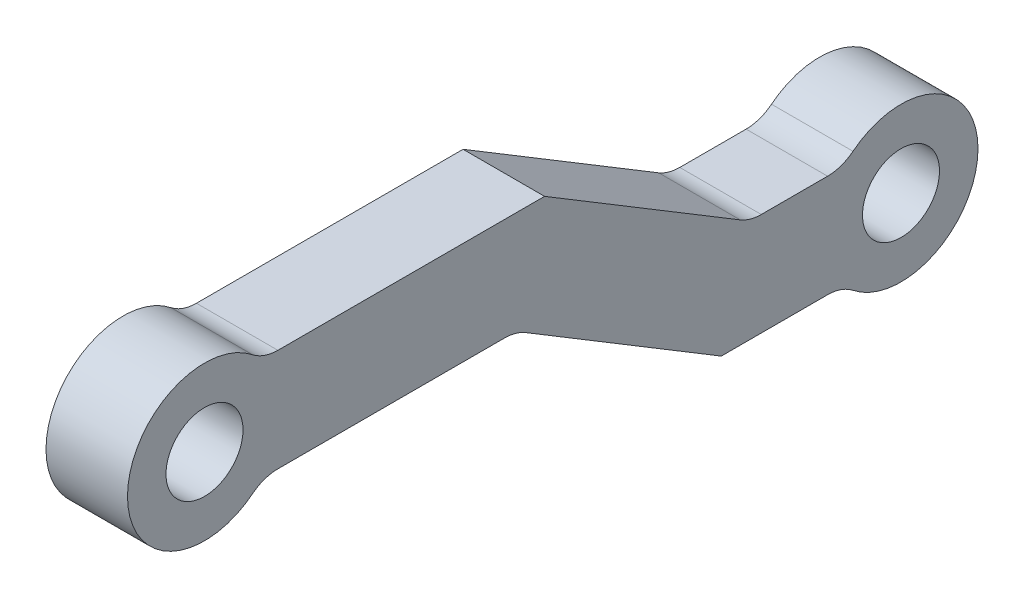
ISO-10303-21;
HEADER;
FILE_DESCRIPTION(('STEP AP214'),'2;1');
FILE_NAME('part.step','',(''),(''),'','','');
FILE_SCHEMA(('AUTOMOTIVE_DESIGN { 1 0 10303 214 1 1 1 1 }'));
ENDSEC;
DATA;
#1=APPLICATION_CONTEXT('core data for automotive mechanical design processes');
#2=APPLICATION_PROTOCOL_DEFINITION('international standard','automotive_design',2000,#1);
#3=PRODUCT_CONTEXT('',#1,'mechanical');
#4=PRODUCT('Part','Part','',(#3));
#5=PRODUCT_RELATED_PRODUCT_CATEGORY('part','',(#4));
#6=PRODUCT_DEFINITION_FORMATION('','',#4);
#7=PRODUCT_DEFINITION_CONTEXT('part definition',#1,'design');
#8=PRODUCT_DEFINITION('design','',#6,#7);
#9=PRODUCT_DEFINITION_SHAPE('','',#8);
#10=(LENGTH_UNIT() NAMED_UNIT(*) SI_UNIT(.MILLI.,.METRE.));
#11=(NAMED_UNIT(*) PLANE_ANGLE_UNIT() SI_UNIT($,.RADIAN.));
#12=(NAMED_UNIT(*) SI_UNIT($,.STERADIAN.) SOLID_ANGLE_UNIT());
#13=UNCERTAINTY_MEASURE_WITH_UNIT(LENGTH_MEASURE(1.E-05),#10,'distance_accuracy_value','');
#14=(GEOMETRIC_REPRESENTATION_CONTEXT(3) GLOBAL_UNCERTAINTY_ASSIGNED_CONTEXT((#13)) GLOBAL_UNIT_ASSIGNED_CONTEXT((#10,
#11,#12)) REPRESENTATION_CONTEXT('',''));
#15=CARTESIAN_POINT('',(0.,0.,0.));
#16=DIRECTION('',(0.,0.,1.));
#17=DIRECTION('',(1.,0.,0.));
#18=AXIS2_PLACEMENT_3D('',#15,#16,#17);
#19=CARTESIAN_POINT('',(3.175,-2.83310697109517,0.));
#20=DIRECTION('',(0.,1.,0.));
#21=DIRECTION('',(0.,0.,1.));
#22=AXIS2_PLACEMENT_3D('',#19,#20,#21);
#23=PLANE('',#22);
#24=DIRECTION('',(0.,0.,-1.));
#25=VECTOR('',#24,1.);
#26=CARTESIAN_POINT('',(0.,-2.83310697109517,0.));
#27=LINE('',#26,#25);
#28=CARTESIAN_POINT('',(0.,-2.83310697109517,-21.689696054792));
#29=VERTEX_POINT('',#28);
#30=CARTESIAN_POINT('',(0.,-2.83310697109517,-24.2737119489963));
#31=VERTEX_POINT('',#30);
#32=EDGE_CURVE('E257',#29,#31,#27,.T.);
#33=ORIENTED_EDGE('',*,*,#32,.F.);
#34=DIRECTION('',(-1.,0.,0.));
#35=VECTOR('',#34,1.);
#36=CARTESIAN_POINT('',(3.175,-2.83310697109517,-21.689696054792));
#37=LINE('',#36,#35);
#38=CARTESIAN_POINT('',(3.175,-2.83310697109517,-21.689696054792));
#39=VERTEX_POINT('',#38);
#40=EDGE_CURVE('E327',#29,#39,#37,.F.);
#41=ORIENTED_EDGE('',*,*,#40,.T.);
#42=DIRECTION('',(0.,0.,-1.));
#43=VECTOR('',#42,1.);
#44=CARTESIAN_POINT('',(3.175,-2.83310697109517,0.));
#45=LINE('',#44,#43);
#46=CARTESIAN_POINT('',(3.175,-2.83310697109517,-24.2737119489963));
#47=VERTEX_POINT('',#46);
#48=EDGE_CURVE('E241',#39,#47,#45,.T.);
#49=ORIENTED_EDGE('',*,*,#48,.T.);
#50=DIRECTION('',(-1.,0.,0.));
#51=VECTOR('',#50,1.);
#52=CARTESIAN_POINT('',(3.175,-2.83310697109517,-24.2737119489963));
#53=LINE('',#52,#51);
#54=EDGE_CURVE('E323',#47,#31,#53,.T.);
#55=ORIENTED_EDGE('',*,*,#54,.T.);
#56=EDGE_LOOP('',(#33,#41,#49,#55));
#57=FACE_BOUND('',#56,.T.);
#58=ADVANCED_FACE('F113',(#57),#23,.T.);
#59=CARTESIAN_POINT('',(3.175,7.32848216707025,-4.42741728115174));
#60=DIRECTION('',(0.,0.855926261123693,-0.517097897422544));
#61=DIRECTION('',(0.,0.517097897422544,0.855926261123693));
#62=AXIS2_PLACEMENT_3D('',#59,#60,#61);
#63=PLANE('',#62);
#64=DIRECTION('',(0.,-0.517097897422544,-0.855926261123693));
#65=VECTOR('',#64,1.);
#66=CARTESIAN_POINT('',(3.175,7.32848216707025,-4.42741728115174));
#67=LINE('',#66,#65);
#68=CARTESIAN_POINT('',(3.175,2.,-13.2473870421154));
#69=VERTEX_POINT('',#68);
#70=CARTESIAN_POINT('',(3.175,-2.60438991062904,-20.8688031426337));
#71=VERTEX_POINT('',#70);
#72=EDGE_CURVE('E221',#69,#71,#67,.T.);
#73=ORIENTED_EDGE('',*,*,#72,.T.);
#74=DIRECTION('',(-1.,0.,0.));
#75=VECTOR('',#74,1.);
#76=CARTESIAN_POINT('',(0.,-2.60438991062904,-20.8688031426337));
#77=LINE('',#76,#75);
#78=CARTESIAN_POINT('',(0.,-2.60438991062904,-20.8688031426337));
#79=VERTEX_POINT('',#78);
#80=EDGE_CURVE('E320',#71,#79,#77,.T.);
#81=ORIENTED_EDGE('',*,*,#80,.T.);
#82=DIRECTION('',(0.,-0.517097897422544,-0.855926261123693));
#83=VECTOR('',#82,1.);
#84=CARTESIAN_POINT('',(0.,7.32848216707025,-4.42741728115174));
#85=LINE('',#84,#83);
#86=CARTESIAN_POINT('',(0.,2.,-13.2473870421154));
#87=VERTEX_POINT('',#86);
#88=EDGE_CURVE('E229',#87,#79,#85,.T.);
#89=ORIENTED_EDGE('',*,*,#88,.F.);
#90=DIRECTION('',(-1.,0.,0.));
#91=VECTOR('',#90,1.);
#92=CARTESIAN_POINT('',(3.175,2.,-13.2473870421154));
#93=LINE('',#92,#91);
#94=EDGE_CURVE('E214',#69,#87,#93,.T.);
#95=ORIENTED_EDGE('',*,*,#94,.F.);
#96=EDGE_LOOP('',(#73,#81,#89,#95));
#97=FACE_BOUND('',#96,.T.);
#98=ADVANCED_FACE('F225',(#97),#63,.T.);
#99=CARTESIAN_POINT('',(3.175,2.,0.));
#100=DIRECTION('',(0.,1.,0.));
#101=DIRECTION('',(0.,0.,1.));
#102=AXIS2_PLACEMENT_3D('',#99,#100,#101);
#103=PLANE('',#102);
#104=DIRECTION('',(0.,0.,-1.));
#105=VECTOR('',#104,1.);
#106=CARTESIAN_POINT('',(0.,2.,0.));
#107=LINE('',#106,#105);
#108=CARTESIAN_POINT('',(0.,2.,-2.85919569109916));
#109=VERTEX_POINT('',#108);
#110=EDGE_CURVE('E264',#109,#87,#107,.T.);
#111=ORIENTED_EDGE('',*,*,#110,.F.);
#112=DIRECTION('',(-1.,0.,0.));
#113=VECTOR('',#112,1.);
#114=CARTESIAN_POINT('',(3.175,2.,-2.85919569109916));
#115=LINE('',#114,#113);
#116=CARTESIAN_POINT('',(3.175,2.,-2.85919569109916));
#117=VERTEX_POINT('',#116);
#118=EDGE_CURVE('E129',#109,#117,#115,.F.);
#119=ORIENTED_EDGE('',*,*,#118,.T.);
#120=DIRECTION('',(0.,0.,-1.));
#121=VECTOR('',#120,1.);
#122=CARTESIAN_POINT('',(3.175,2.,0.));
#123=LINE('',#122,#121);
#124=EDGE_CURVE('E211',#117,#69,#123,.T.);
#125=ORIENTED_EDGE('',*,*,#124,.T.);
#126=ORIENTED_EDGE('',*,*,#94,.T.);
#127=EDGE_LOOP('',(#111,#119,#125,#126));
#128=FACE_BOUND('',#127,.T.);
#129=ADVANCED_FACE('F213',(#128),#103,.T.);
#130=CARTESIAN_POINT('',(3.175,-2.,0.));
#131=DIRECTION('',(0.,1.,0.));
#132=DIRECTION('',(0.,0.,1.));
#133=AXIS2_PLACEMENT_3D('',#130,#131,#132);
#134=PLANE('',#133);
#135=DIRECTION('',(0.,0.,-1.));
#136=VECTOR('',#135,1.);
#137=CARTESIAN_POINT('',(0.,-2.,0.));
#138=LINE('',#137,#136);
#139=CARTESIAN_POINT('',(0.,-2.,-2.85919569109916));
#140=VERTEX_POINT('',#139);
#141=CARTESIAN_POINT('',(0.,-2.,-11.6905986274188));
#142=VERTEX_POINT('',#141);
#143=EDGE_CURVE('E267',#140,#142,#138,.T.);
#144=ORIENTED_EDGE('',*,*,#143,.T.);
#145=DIRECTION('',(-1.,0.,0.));
#146=VECTOR('',#145,1.);
#147=CARTESIAN_POINT('',(3.175,-2.,-11.6905986274188));
#148=LINE('',#147,#146);
#149=CARTESIAN_POINT('',(3.175,-2.,-11.6905986274188));
#150=VERTEX_POINT('',#149);
#151=EDGE_CURVE('E338',#142,#150,#148,.F.);
#152=ORIENTED_EDGE('',*,*,#151,.T.);
#153=DIRECTION('',(0.,0.,-1.));
#154=VECTOR('',#153,1.);
#155=CARTESIAN_POINT('',(3.175,-2.,0.));
#156=LINE('',#155,#154);
#157=CARTESIAN_POINT('',(3.175,-2.,-2.85919569109916));
#158=VERTEX_POINT('',#157);
#159=EDGE_CURVE('E220',#158,#150,#156,.T.);
#160=ORIENTED_EDGE('',*,*,#159,.F.);
#161=DIRECTION('',(1.,0.,0.));
#162=VECTOR('',#161,1.);
#163=CARTESIAN_POINT('',(0.,-2.,-2.85919569109916));
#164=LINE('',#163,#162);
#165=EDGE_CURVE('E334',#158,#140,#164,.F.);
#166=ORIENTED_EDGE('',*,*,#165,.T.);
#167=EDGE_LOOP('',(#144,#152,#160,#166));
#168=FACE_BOUND('',#167,.T.);
#169=ADVANCED_FACE('F412',(#168),#134,.F.);
#170=CARTESIAN_POINT('',(3.175,3.90477712257548,-2.35902569146156));
#171=DIRECTION('',(0.,0.855926261123693,-0.517097897422544));
#172=DIRECTION('',(0.,0.517097897422544,0.855926261123693));
#173=AXIS2_PLACEMENT_3D('',#170,#171,#172);
#174=PLANE('',#173);
#175=DIRECTION('',(0.,-0.517097897422544,-0.855926261123693));
#176=VECTOR('',#175,1.);
#177=CARTESIAN_POINT('',(3.175,3.90477712257548,-2.35902569146156));
#178=LINE('',#177,#176);
#179=CARTESIAN_POINT('',(3.175,-2.22871706046614,-12.5114915395771));
#180=VERTEX_POINT('',#179);
#181=CARTESIAN_POINT('',(3.175,-6.83310697109518,-20.1329076400955));
#182=VERTEX_POINT('',#181);
#183=EDGE_CURVE('E251',#180,#182,#178,.T.);
#184=ORIENTED_EDGE('',*,*,#183,.F.);
#185=DIRECTION('',(-1.,0.,0.));
#186=VECTOR('',#185,1.);
#187=CARTESIAN_POINT('',(0.,-2.22871706046614,-12.5114915395771));
#188=LINE('',#187,#186);
#189=CARTESIAN_POINT('',(0.,-2.22871706046614,-12.5114915395771));
#190=VERTEX_POINT('',#189);
#191=EDGE_CURVE('E330',#180,#190,#188,.T.);
#192=ORIENTED_EDGE('',*,*,#191,.T.);
#193=DIRECTION('',(0.,-0.517097897422544,-0.855926261123693));
#194=VECTOR('',#193,1.);
#195=CARTESIAN_POINT('',(0.,3.90477712257548,-2.35902569146156));
#196=LINE('',#195,#194);
#197=CARTESIAN_POINT('',(0.,-6.83310697109518,-20.1329076400955));
#198=VERTEX_POINT('',#197);
#199=EDGE_CURVE('E271',#190,#198,#196,.T.);
#200=ORIENTED_EDGE('',*,*,#199,.T.);
#201=DIRECTION('',(-1.,0.,0.));
#202=VECTOR('',#201,1.);
#203=CARTESIAN_POINT('',(3.175,-6.83310697109518,-20.1329076400955));
#204=LINE('',#203,#202);
#205=EDGE_CURVE('E232',#182,#198,#204,.T.);
#206=ORIENTED_EDGE('',*,*,#205,.F.);
#207=EDGE_LOOP('',(#184,#192,#200,#206));
#208=FACE_BOUND('',#207,.T.);
#209=ADVANCED_FACE('F406',(#208),#174,.F.);
#210=CARTESIAN_POINT('',(3.175,-6.83310697109517,0.));
#211=DIRECTION('',(0.,1.,0.));
#212=DIRECTION('',(0.,0.,1.));
#213=AXIS2_PLACEMENT_3D('',#210,#211,#212);
#214=PLANE('',#213);
#215=DIRECTION('',(0.,0.,-1.));
#216=VECTOR('',#215,1.);
#217=CARTESIAN_POINT('',(0.,-6.83310697109517,0.));
#218=LINE('',#217,#216);
#219=CARTESIAN_POINT('',(0.,-6.83310697109517,-24.2737119489963));
#220=VERTEX_POINT('',#219);
#221=EDGE_CURVE('E245',#198,#220,#218,.T.);
#222=ORIENTED_EDGE('',*,*,#221,.T.);
#223=DIRECTION('',(1.,0.,0.));
#224=VECTOR('',#223,1.);
#225=CARTESIAN_POINT('',(3.175,-6.83310697109517,-24.2737119489963));
#226=LINE('',#225,#224);
#227=CARTESIAN_POINT('',(3.175,-6.83310697109517,-24.2737119489963));
#228=VERTEX_POINT('',#227);
#229=EDGE_CURVE('E317',#220,#228,#226,.T.);
#230=ORIENTED_EDGE('',*,*,#229,.T.);
#231=DIRECTION('',(0.,0.,-1.));
#232=VECTOR('',#231,1.);
#233=CARTESIAN_POINT('',(3.175,-6.83310697109517,0.));
#234=LINE('',#233,#232);
#235=EDGE_CURVE('E254',#182,#228,#234,.T.);
#236=ORIENTED_EDGE('',*,*,#235,.F.);
#237=ORIENTED_EDGE('',*,*,#205,.T.);
#238=EDGE_LOOP('',(#222,#230,#236,#237));
#239=FACE_BOUND('',#238,.T.);
#240=ADVANCED_FACE('F401',(#239),#214,.F.);
#241=CARTESIAN_POINT('',(0.,0.,0.));
#242=DIRECTION('',(1.,0.,0.));
#243=DIRECTION('',(0.,0.,-1.));
#244=AXIS2_PLACEMENT_3D('',#241,#242,#243);
#245=PLANE('',#244);
#246=ORIENTED_EDGE('',*,*,#88,.T.);
#247=CARTESIAN_POINT('',(0.,-1.24560697109517,-21.689696054792));
#248=DIRECTION('',(1.,0.,0.));
#249=DIRECTION('',(0.,0.,-1.));
#250=AXIS2_PLACEMENT_3D('',#247,#248,#249);
#251=CIRCLE('',#250,1.5875);
#252=EDGE_CURVE('E356',#79,#29,#251,.T.);
#253=ORIENTED_EDGE('',*,*,#252,.T.);
#254=ORIENTED_EDGE('',*,*,#32,.T.);
#255=CARTESIAN_POINT('',(0.,-1.24560697109517,-24.2737119489963));
#256=DIRECTION('',(1.,0.,0.));
#257=DIRECTION('',(0.,0.,-1.));
#258=AXIS2_PLACEMENT_3D('',#255,#256,#257);
#259=CIRCLE('',#258,1.5875);
#260=CARTESIAN_POINT('',(0.,-2.48705792477365,-25.2631338911478));
#261=VERTEX_POINT('',#260);
#262=EDGE_CURVE('E373',#31,#261,#259,.T.);
#263=ORIENTED_EDGE('',*,*,#262,.T.);
#264=CARTESIAN_POINT('',(0.,-4.83310697109517,-27.1329076400955));
#265=DIRECTION('',(1.,0.,0.));
#266=DIRECTION('',(0.,0.,-1.));
#267=AXIS2_PLACEMENT_3D('',#264,#265,#266);
#268=CIRCLE('',#267,2.99999999999999);
#269=CARTESIAN_POINT('',(0.,-7.1791560174167,-25.2631338911478));
#270=VERTEX_POINT('',#269);
#271=EDGE_CURVE('E300',#270,#261,#268,.T.);
#272=ORIENTED_EDGE('',*,*,#271,.F.);
#273=CARTESIAN_POINT('',(0.,-8.42060697109518,-24.2737119489963));
#274=DIRECTION('',(1.,0.,0.));
#275=DIRECTION('',(0.,0.,-1.));
#276=AXIS2_PLACEMENT_3D('',#273,#274,#275);
#277=CIRCLE('',#276,1.5875);
#278=EDGE_CURVE('E350',#270,#220,#277,.T.);
#279=ORIENTED_EDGE('',*,*,#278,.T.);
#280=ORIENTED_EDGE('',*,*,#221,.F.);
#281=ORIENTED_EDGE('',*,*,#199,.F.);
#282=CARTESIAN_POINT('',(0.,-3.5875,-11.6905986274188));
#283=DIRECTION('',(1.,0.,0.));
#284=DIRECTION('',(0.,0.,-1.));
#285=AXIS2_PLACEMENT_3D('',#282,#283,#284);
#286=CIRCLE('',#285,1.5875);
#287=EDGE_CURVE('E361',#190,#142,#286,.T.);
#288=ORIENTED_EDGE('',*,*,#287,.T.);
#289=ORIENTED_EDGE('',*,*,#143,.F.);
#290=CARTESIAN_POINT('',(0.,-3.5875,-2.85919569109916));
#291=DIRECTION('',(1.,0.,0.));
#292=DIRECTION('',(0.,0.,-1.));
#293=AXIS2_PLACEMENT_3D('',#290,#291,#292);
#294=CIRCLE('',#293,1.5875);
#295=CARTESIAN_POINT('',(0.,-2.34604904632153,-1.86977374894768));
#296=VERTEX_POINT('',#295);
#297=EDGE_CURVE('E367',#140,#296,#294,.T.);
#298=ORIENTED_EDGE('',*,*,#297,.T.);
#299=CARTESIAN_POINT('',(0.,0.,0.));
#300=DIRECTION('',(1.,0.,0.));
#301=DIRECTION('',(0.,0.,-1.));
#302=AXIS2_PLACEMENT_3D('',#299,#300,#301);
#303=CIRCLE('',#302,3.);
#304=CARTESIAN_POINT('',(0.,2.34604904632153,-1.86977374894768));
#305=VERTEX_POINT('',#304);
#306=EDGE_CURVE('E284',#305,#296,#303,.T.);
#307=ORIENTED_EDGE('',*,*,#306,.F.);
#308=CARTESIAN_POINT('',(0.,3.5875,-2.85919569109916));
#309=DIRECTION('',(1.,0.,0.));
#310=DIRECTION('',(0.,0.,-1.));
#311=AXIS2_PLACEMENT_3D('',#308,#309,#310);
#312=CIRCLE('',#311,1.5875);
#313=EDGE_CURVE('E122',#305,#109,#312,.T.);
#314=ORIENTED_EDGE('',*,*,#313,.T.);
#315=ORIENTED_EDGE('',*,*,#110,.T.);
#316=EDGE_LOOP('',(#246,#253,#254,#263,#272,#279,#280,#281,#288,#289,#298,#307,#314,#315));
#317=FACE_BOUND('',#316,.T.);
#318=CARTESIAN_POINT('',(0.,0.,0.));
#319=DIRECTION('',(1.,0.,0.));
#320=DIRECTION('',(0.,0.,-1.));
#321=AXIS2_PLACEMENT_3D('',#318,#319,#320);
#322=CIRCLE('',#321,1.5);
#323=CARTESIAN_POINT('',(0.,0.,-1.5));
#324=VERTEX_POINT('',#323);
#325=EDGE_CURVE('E285',#324,#324,#322,.T.);
#326=ORIENTED_EDGE('',*,*,#325,.T.);
#327=EDGE_LOOP('',(#326));
#328=FACE_BOUND('',#327,.T.);
#329=CARTESIAN_POINT('',(0.,-4.83310697109517,-27.1329076400955));
#330=DIRECTION('',(1.,0.,0.));
#331=DIRECTION('',(0.,0.,-1.));
#332=AXIS2_PLACEMENT_3D('',#329,#330,#331);
#333=CIRCLE('',#332,1.5);
#334=CARTESIAN_POINT('',(0.,-4.83310697109517,-28.6329076400955));
#335=VERTEX_POINT('',#334);
#336=EDGE_CURVE('E301',#335,#335,#333,.T.);
#337=ORIENTED_EDGE('',*,*,#336,.T.);
#338=EDGE_LOOP('',(#337));
#339=FACE_BOUND('',#338,.T.);
#340=ADVANCED_FACE('F389',(#317,#328,#339),#245,.F.);
#341=CARTESIAN_POINT('',(3.175,0.,0.));
#342=DIRECTION('',(1.,0.,0.));
#343=DIRECTION('',(0.,0.,-1.));
#344=AXIS2_PLACEMENT_3D('',#341,#342,#343);
#345=PLANE('',#344);
#346=ORIENTED_EDGE('',*,*,#235,.T.);
#347=CARTESIAN_POINT('',(3.175,-8.42060697109518,-24.2737119489963));
#348=DIRECTION('',(1.,0.,0.));
#349=DIRECTION('',(0.,0.,-1.));
#350=AXIS2_PLACEMENT_3D('',#347,#348,#349);
#351=CIRCLE('',#350,1.5875);
#352=CARTESIAN_POINT('',(3.175,-7.1791560174167,-25.2631338911478));
#353=VERTEX_POINT('',#352);
#354=EDGE_CURVE('E353',#228,#353,#351,.F.);
#355=ORIENTED_EDGE('',*,*,#354,.T.);
#356=CARTESIAN_POINT('',(3.175,-4.83310697109517,-27.1329076400955));
#357=DIRECTION('',(1.,0.,0.));
#358=DIRECTION('',(0.,0.,-1.));
#359=AXIS2_PLACEMENT_3D('',#356,#357,#358);
#360=CIRCLE('',#359,2.99999999999999);
#361=CARTESIAN_POINT('',(3.175,-2.48705792477365,-25.2631338911478));
#362=VERTEX_POINT('',#361);
#363=EDGE_CURVE('E289',#353,#362,#360,.T.);
#364=ORIENTED_EDGE('',*,*,#363,.T.);
#365=CARTESIAN_POINT('',(3.175,-1.24560697109517,-24.2737119489963));
#366=DIRECTION('',(1.,0.,0.));
#367=DIRECTION('',(0.,0.,-1.));
#368=AXIS2_PLACEMENT_3D('',#365,#366,#367);
#369=CIRCLE('',#368,1.5875);
#370=EDGE_CURVE('E376',#362,#47,#369,.F.);
#371=ORIENTED_EDGE('',*,*,#370,.T.);
#372=ORIENTED_EDGE('',*,*,#48,.F.);
#373=CARTESIAN_POINT('',(3.175,-1.24560697109517,-21.689696054792));
#374=DIRECTION('',(1.,0.,0.));
#375=DIRECTION('',(0.,0.,-1.));
#376=AXIS2_PLACEMENT_3D('',#373,#374,#375);
#377=CIRCLE('',#376,1.5875);
#378=EDGE_CURVE('E239',#39,#71,#377,.F.);
#379=ORIENTED_EDGE('',*,*,#378,.T.);
#380=ORIENTED_EDGE('',*,*,#72,.F.);
#381=ORIENTED_EDGE('',*,*,#124,.F.);
#382=CARTESIAN_POINT('',(3.175,3.5875,-2.85919569109916));
#383=DIRECTION('',(1.,0.,0.));
#384=DIRECTION('',(0.,0.,-1.));
#385=AXIS2_PLACEMENT_3D('',#382,#383,#384);
#386=CIRCLE('',#385,1.5875);
#387=CARTESIAN_POINT('',(3.175,2.34604904632153,-1.86977374894768));
#388=VERTEX_POINT('',#387);
#389=EDGE_CURVE('E12',#117,#388,#386,.F.);
#390=ORIENTED_EDGE('',*,*,#389,.T.);
#391=CARTESIAN_POINT('',(3.175,0.,0.));
#392=DIRECTION('',(1.,0.,0.));
#393=DIRECTION('',(0.,0.,-1.));
#394=AXIS2_PLACEMENT_3D('',#391,#392,#393);
#395=CIRCLE('',#394,3.);
#396=CARTESIAN_POINT('',(3.175,-2.34604904632153,-1.86977374894768));
#397=VERTEX_POINT('',#396);
#398=EDGE_CURVE('E261',#388,#397,#395,.T.);
#399=ORIENTED_EDGE('',*,*,#398,.T.);
#400=CARTESIAN_POINT('',(3.175,-3.5875,-2.85919569109916));
#401=DIRECTION('',(1.,0.,0.));
#402=DIRECTION('',(0.,0.,-1.));
#403=AXIS2_PLACEMENT_3D('',#400,#401,#402);
#404=CIRCLE('',#403,1.5875);
#405=EDGE_CURVE('E370',#397,#158,#404,.F.);
#406=ORIENTED_EDGE('',*,*,#405,.T.);
#407=ORIENTED_EDGE('',*,*,#159,.T.);
#408=CARTESIAN_POINT('',(3.175,-3.5875,-11.6905986274188));
#409=DIRECTION('',(1.,0.,0.));
#410=DIRECTION('',(0.,0.,-1.));
#411=AXIS2_PLACEMENT_3D('',#408,#409,#410);
#412=CIRCLE('',#411,1.5875);
#413=EDGE_CURVE('E364',#150,#180,#412,.F.);
#414=ORIENTED_EDGE('',*,*,#413,.T.);
#415=ORIENTED_EDGE('',*,*,#183,.T.);
#416=EDGE_LOOP('',(#346,#355,#364,#371,#372,#379,#380,#381,#390,#399,#406,#407,#414,#415));
#417=FACE_BOUND('',#416,.T.);
#418=CARTESIAN_POINT('',(3.175,0.,0.));
#419=DIRECTION('',(1.,0.,0.));
#420=DIRECTION('',(0.,0.,-1.));
#421=AXIS2_PLACEMENT_3D('',#418,#419,#420);
#422=CIRCLE('',#421,1.5);
#423=CARTESIAN_POINT('',(3.175,0.,-1.5));
#424=VERTEX_POINT('',#423);
#425=EDGE_CURVE('E280',#424,#424,#422,.T.);
#426=ORIENTED_EDGE('',*,*,#425,.F.);
#427=EDGE_LOOP('',(#426));
#428=FACE_BOUND('',#427,.T.);
#429=CARTESIAN_POINT('',(3.175,-4.83310697109517,-27.1329076400955));
#430=DIRECTION('',(1.,0.,0.));
#431=DIRECTION('',(0.,0.,-1.));
#432=AXIS2_PLACEMENT_3D('',#429,#430,#431);
#433=CIRCLE('',#432,1.5);
#434=CARTESIAN_POINT('',(3.175,-4.83310697109517,-28.6329076400955));
#435=VERTEX_POINT('',#434);
#436=EDGE_CURVE('E296',#435,#435,#433,.T.);
#437=ORIENTED_EDGE('',*,*,#436,.F.);
#438=EDGE_LOOP('',(#437));
#439=FACE_BOUND('',#438,.T.);
#440=ADVANCED_FACE('F235',(#417,#428,#439),#345,.T.);
#441=CARTESIAN_POINT('',(3.175,-4.83310697109517,-27.1329076400955));
#442=DIRECTION('',(-1.,0.,0.));
#443=DIRECTION('',(0.,0.,1.));
#444=AXIS2_PLACEMENT_3D('',#441,#442,#443);
#445=CYLINDRICAL_SURFACE('',#444,1.5);
#446=ORIENTED_EDGE('',*,*,#436,.T.);
#447=EDGE_LOOP('',(#446));
#448=FACE_BOUND('',#447,.T.);
#449=ORIENTED_EDGE('',*,*,#336,.F.);
#450=EDGE_LOOP('',(#449));
#451=FACE_BOUND('',#450,.T.);
#452=ADVANCED_FACE('F444',(#448,#451),#445,.F.);
#453=CARTESIAN_POINT('',(3.175,-4.83310697109517,-27.1329076400955));
#454=DIRECTION('',(-1.,0.,0.));
#455=DIRECTION('',(0.,0.,1.));
#456=AXIS2_PLACEMENT_3D('',#453,#454,#455);
#457=CYLINDRICAL_SURFACE('',#456,2.99999999999999);
#458=ORIENTED_EDGE('',*,*,#363,.F.);
#459=DIRECTION('',(-1.,0.,0.));
#460=VECTOR('',#459,1.);
#461=CARTESIAN_POINT('',(3.175,-7.1791560174167,-25.2631338911478));
#462=LINE('',#461,#460);
#463=EDGE_CURVE('E313',#353,#270,#462,.T.);
#464=ORIENTED_EDGE('',*,*,#463,.T.);
#465=ORIENTED_EDGE('',*,*,#271,.T.);
#466=DIRECTION('',(-1.,0.,0.));
#467=VECTOR('',#466,1.);
#468=CARTESIAN_POINT('',(3.175,-2.48705792477365,-25.2631338911478));
#469=LINE('',#468,#467);
#470=EDGE_CURVE('E231',#261,#362,#469,.F.);
#471=ORIENTED_EDGE('',*,*,#470,.T.);
#472=EDGE_LOOP('',(#458,#464,#465,#471));
#473=FACE_BOUND('',#472,.T.);
#474=ADVANCED_FACE('F392',(#473),#457,.T.);
#475=CARTESIAN_POINT('',(3.175,0.,0.));
#476=DIRECTION('',(-1.,0.,0.));
#477=DIRECTION('',(0.,0.,1.));
#478=AXIS2_PLACEMENT_3D('',#475,#476,#477);
#479=CYLINDRICAL_SURFACE('',#478,1.5);
#480=ORIENTED_EDGE('',*,*,#425,.T.);
#481=EDGE_LOOP('',(#480));
#482=FACE_BOUND('',#481,.T.);
#483=ORIENTED_EDGE('',*,*,#325,.F.);
#484=EDGE_LOOP('',(#483));
#485=FACE_BOUND('',#484,.T.);
#486=ADVANCED_FACE('F439',(#482,#485),#479,.F.);
#487=CARTESIAN_POINT('',(3.175,0.,0.));
#488=DIRECTION('',(-1.,0.,0.));
#489=DIRECTION('',(0.,0.,1.));
#490=AXIS2_PLACEMENT_3D('',#487,#488,#489);
#491=CYLINDRICAL_SURFACE('',#490,3.);
#492=ORIENTED_EDGE('',*,*,#306,.T.);
#493=DIRECTION('',(-1.,0.,0.));
#494=VECTOR('',#493,1.);
#495=CARTESIAN_POINT('',(3.175,-2.34604904632153,-1.86977374894768));
#496=LINE('',#495,#494);
#497=EDGE_CURVE('E345',#296,#397,#496,.F.);
#498=ORIENTED_EDGE('',*,*,#497,.T.);
#499=ORIENTED_EDGE('',*,*,#398,.F.);
#500=DIRECTION('',(-1.,0.,0.));
#501=VECTOR('',#500,1.);
#502=CARTESIAN_POINT('',(3.175,2.34604904632153,-1.86977374894768));
#503=LINE('',#502,#501);
#504=EDGE_CURVE('E341',#388,#305,#503,.T.);
#505=ORIENTED_EDGE('',*,*,#504,.T.);
#506=EDGE_LOOP('',(#492,#498,#499,#505));
#507=FACE_BOUND('',#506,.T.);
#508=ADVANCED_FACE('F422',(#507),#491,.T.);
#509=CARTESIAN_POINT('',(3.175,-8.42060697109518,-24.2737119489963));
#510=DIRECTION('',(-1.,0.,0.));
#511=DIRECTION('',(0.,0.,1.));
#512=AXIS2_PLACEMENT_3D('',#509,#510,#511);
#513=CYLINDRICAL_SURFACE('',#512,1.5875);
#514=ORIENTED_EDGE('',*,*,#354,.F.);
#515=ORIENTED_EDGE('',*,*,#229,.F.);
#516=ORIENTED_EDGE('',*,*,#278,.F.);
#517=ORIENTED_EDGE('',*,*,#463,.F.);
#518=EDGE_LOOP('',(#514,#515,#516,#517));
#519=FACE_BOUND('',#518,.T.);
#520=ADVANCED_FACE('F396',(#519),#513,.F.);
#521=CARTESIAN_POINT('',(3.175,-1.24560697109517,-21.689696054792));
#522=DIRECTION('',(1.,0.,0.));
#523=DIRECTION('',(0.,0.,-1.));
#524=AXIS2_PLACEMENT_3D('',#521,#522,#523);
#525=CYLINDRICAL_SURFACE('',#524,1.5875);
#526=ORIENTED_EDGE('',*,*,#378,.F.);
#527=ORIENTED_EDGE('',*,*,#40,.F.);
#528=ORIENTED_EDGE('',*,*,#252,.F.);
#529=ORIENTED_EDGE('',*,*,#80,.F.);
#530=EDGE_LOOP('',(#526,#527,#528,#529));
#531=FACE_BOUND('',#530,.T.);
#532=ADVANCED_FACE('F452',(#531),#525,.F.);
#533=CARTESIAN_POINT('',(3.175,-3.5875,-11.6905986274188));
#534=DIRECTION('',(1.,0.,0.));
#535=DIRECTION('',(0.,0.,-1.));
#536=AXIS2_PLACEMENT_3D('',#533,#534,#535);
#537=CYLINDRICAL_SURFACE('',#536,1.5875);
#538=ORIENTED_EDGE('',*,*,#413,.F.);
#539=ORIENTED_EDGE('',*,*,#151,.F.);
#540=ORIENTED_EDGE('',*,*,#287,.F.);
#541=ORIENTED_EDGE('',*,*,#191,.F.);
#542=EDGE_LOOP('',(#538,#539,#540,#541));
#543=FACE_BOUND('',#542,.T.);
#544=ADVANCED_FACE('F416',(#543),#537,.F.);
#545=CARTESIAN_POINT('',(3.175,-3.5875,-2.85919569109916));
#546=DIRECTION('',(-1.,0.,0.));
#547=DIRECTION('',(0.,0.,1.));
#548=AXIS2_PLACEMENT_3D('',#545,#546,#547);
#549=CYLINDRICAL_SURFACE('',#548,1.5875);
#550=ORIENTED_EDGE('',*,*,#405,.F.);
#551=ORIENTED_EDGE('',*,*,#497,.F.);
#552=ORIENTED_EDGE('',*,*,#297,.F.);
#553=ORIENTED_EDGE('',*,*,#165,.F.);
#554=EDGE_LOOP('',(#550,#551,#552,#553));
#555=FACE_BOUND('',#554,.T.);
#556=ADVANCED_FACE('F419',(#555),#549,.F.);
#557=CARTESIAN_POINT('',(3.175,-1.24560697109517,-24.2737119489963));
#558=DIRECTION('',(-1.,0.,0.));
#559=DIRECTION('',(0.,0.,1.));
#560=AXIS2_PLACEMENT_3D('',#557,#558,#559);
#561=CYLINDRICAL_SURFACE('',#560,1.5875);
#562=ORIENTED_EDGE('',*,*,#370,.F.);
#563=ORIENTED_EDGE('',*,*,#470,.F.);
#564=ORIENTED_EDGE('',*,*,#262,.F.);
#565=ORIENTED_EDGE('',*,*,#54,.F.);
#566=EDGE_LOOP('',(#562,#563,#564,#565));
#567=FACE_BOUND('',#566,.T.);
#568=ADVANCED_FACE('F387',(#567),#561,.F.);
#569=CARTESIAN_POINT('',(3.175,3.5875,-2.85919569109916));
#570=DIRECTION('',(-1.,0.,0.));
#571=DIRECTION('',(0.,0.,1.));
#572=AXIS2_PLACEMENT_3D('',#569,#570,#571);
#573=CYLINDRICAL_SURFACE('',#572,1.5875);
#574=ORIENTED_EDGE('',*,*,#389,.F.);
#575=ORIENTED_EDGE('',*,*,#118,.F.);
#576=ORIENTED_EDGE('',*,*,#313,.F.);
#577=ORIENTED_EDGE('',*,*,#504,.F.);
#578=EDGE_LOOP('',(#574,#575,#576,#577));
#579=FACE_BOUND('',#578,.T.);
#580=ADVANCED_FACE('F115',(#579),#573,.F.);
#581=CLOSED_SHELL('',(#58,#98,#129,#169,#209,#240,#340,#440,#452,#474,#486,#508,#520,#532,#544,
#556,#568,#580));
#582=MANIFOLD_SOLID_BREP('B2',#581);
#583=ADVANCED_BREP_SHAPE_REPRESENTATION('',(#18,#582),#14);
#584=SHAPE_DEFINITION_REPRESENTATION(#9,#583);
ENDSEC;
END-ISO-10303-21;
